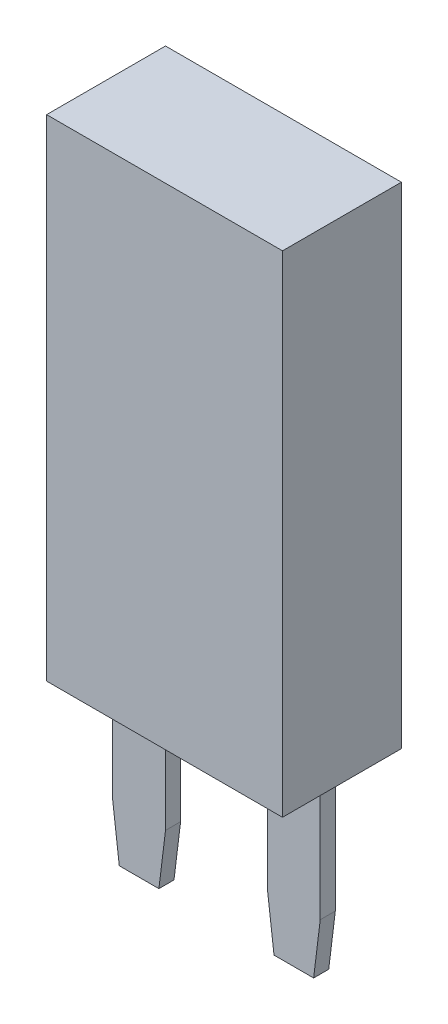
ISO-10303-21;
HEADER;
FILE_DESCRIPTION(('STEP AP214'),'2;1');
FILE_NAME('part.step','',(''),(''),'','','');
FILE_SCHEMA(('AUTOMOTIVE_DESIGN { 1 0 10303 214 1 1 1 1 }'));
ENDSEC;
DATA;
#1=APPLICATION_CONTEXT('core data for automotive mechanical design processes');
#2=APPLICATION_PROTOCOL_DEFINITION('international standard','automotive_design',2000,#1);
#3=PRODUCT_CONTEXT('',#1,'mechanical');
#4=PRODUCT('Part','Part','',(#3));
#5=PRODUCT_RELATED_PRODUCT_CATEGORY('part','',(#4));
#6=PRODUCT_DEFINITION_FORMATION('','',#4);
#7=PRODUCT_DEFINITION_CONTEXT('part definition',#1,'design');
#8=PRODUCT_DEFINITION('design','',#6,#7);
#9=PRODUCT_DEFINITION_SHAPE('','',#8);
#10=(LENGTH_UNIT() NAMED_UNIT(*) SI_UNIT(.MILLI.,.METRE.));
#11=(NAMED_UNIT(*) PLANE_ANGLE_UNIT() SI_UNIT($,.RADIAN.));
#12=(NAMED_UNIT(*) SI_UNIT($,.STERADIAN.) SOLID_ANGLE_UNIT());
#13=UNCERTAINTY_MEASURE_WITH_UNIT(LENGTH_MEASURE(1.E-05),#10,'distance_accuracy_value','');
#14=(GEOMETRIC_REPRESENTATION_CONTEXT(3) GLOBAL_UNCERTAINTY_ASSIGNED_CONTEXT((#13)) GLOBAL_UNIT_ASSIGNED_CONTEXT((#10,
#11,#12)) REPRESENTATION_CONTEXT('',''));
#15=CARTESIAN_POINT('',(0.,0.,0.));
#16=DIRECTION('',(0.,0.,1.));
#17=DIRECTION('',(1.,0.,0.));
#18=AXIS2_PLACEMENT_3D('',#15,#16,#17);
#19=CARTESIAN_POINT('',(-6.25,-13.,3.15));
#20=DIRECTION('',(0.,1.,0.));
#21=DIRECTION('',(0.,0.,1.));
#22=AXIS2_PLACEMENT_3D('',#19,#20,#21);
#23=PLANE('',#22);
#24=DIRECTION('',(0.,0.,-1.));
#25=VECTOR('',#24,1.);
#26=CARTESIAN_POINT('',(-5.5,-13.,0.4));
#27=LINE('',#26,#25);
#28=CARTESIAN_POINT('',(-5.5,-13.,0.4));
#29=VERTEX_POINT('',#28);
#30=CARTESIAN_POINT('',(-5.5,-13.,-0.4));
#31=VERTEX_POINT('',#30);
#32=EDGE_CURVE('E189',#29,#31,#27,.T.);
#33=ORIENTED_EDGE('',*,*,#32,.F.);
#34=DIRECTION('',(-1.,0.,0.));
#35=VECTOR('',#34,1.);
#36=CARTESIAN_POINT('',(-5.5,-13.,0.4));
#37=LINE('',#36,#35);
#38=CARTESIAN_POINT('',(-2.7,-13.,0.4));
#39=VERTEX_POINT('',#38);
#40=EDGE_CURVE('E194',#39,#29,#37,.T.);
#41=ORIENTED_EDGE('',*,*,#40,.F.);
#42=DIRECTION('',(0.,0.,1.));
#43=VECTOR('',#42,1.);
#44=CARTESIAN_POINT('',(-2.7,-13.,0.4));
#45=LINE('',#44,#43);
#46=CARTESIAN_POINT('',(-2.7,-13.,-0.4));
#47=VERTEX_POINT('',#46);
#48=EDGE_CURVE('E203',#47,#39,#45,.T.);
#49=ORIENTED_EDGE('',*,*,#48,.F.);
#50=DIRECTION('',(1.,0.,0.));
#51=VECTOR('',#50,1.);
#52=CARTESIAN_POINT('',(-5.5,-13.,-0.4));
#53=LINE('',#52,#51);
#54=EDGE_CURVE('E200',#31,#47,#53,.T.);
#55=ORIENTED_EDGE('',*,*,#54,.F.);
#56=EDGE_LOOP('',(#33,#41,#49,#55));
#57=FACE_BOUND('',#56,.T.);
#58=DIRECTION('',(1.,0.,0.));
#59=VECTOR('',#58,1.);
#60=CARTESIAN_POINT('',(-6.25,-13.,-3.15));
#61=LINE('',#60,#59);
#62=CARTESIAN_POINT('',(-6.25,-13.,-3.15));
#63=VERTEX_POINT('',#62);
#64=CARTESIAN_POINT('',(6.25,-13.,-3.15));
#65=VERTEX_POINT('',#64);
#66=EDGE_CURVE('E220',#63,#65,#61,.T.);
#67=ORIENTED_EDGE('',*,*,#66,.T.);
#68=DIRECTION('',(0.,0.,-1.));
#69=VECTOR('',#68,1.);
#70=CARTESIAN_POINT('',(6.25,-13.,3.15));
#71=LINE('',#70,#69);
#72=CARTESIAN_POINT('',(6.25,-13.,3.15));
#73=VERTEX_POINT('',#72);
#74=EDGE_CURVE('E226',#73,#65,#71,.T.);
#75=ORIENTED_EDGE('',*,*,#74,.F.);
#76=DIRECTION('',(1.,0.,0.));
#77=VECTOR('',#76,1.);
#78=CARTESIAN_POINT('',(-6.25,-13.,3.15));
#79=LINE('',#78,#77);
#80=CARTESIAN_POINT('',(-6.25,-13.,3.15));
#81=VERTEX_POINT('',#80);
#82=EDGE_CURVE('E224',#81,#73,#79,.T.);
#83=ORIENTED_EDGE('',*,*,#82,.F.);
#84=DIRECTION('',(0.,0.,-1.));
#85=VECTOR('',#84,1.);
#86=CARTESIAN_POINT('',(-6.25,-13.,3.15));
#87=LINE('',#86,#85);
#88=EDGE_CURVE('E236',#81,#63,#87,.T.);
#89=ORIENTED_EDGE('',*,*,#88,.T.);
#90=EDGE_LOOP('',(#67,#75,#83,#89));
#91=FACE_BOUND('',#90,.T.);
#92=DIRECTION('',(-1.,0.,0.));
#93=VECTOR('',#92,1.);
#94=CARTESIAN_POINT('',(5.5,-13.,0.399999999999999));
#95=LINE('',#94,#93);
#96=CARTESIAN_POINT('',(5.5,-13.,0.399999999999999));
#97=VERTEX_POINT('',#96);
#98=CARTESIAN_POINT('',(2.7,-13.,0.399999999999999));
#99=VERTEX_POINT('',#98);
#100=EDGE_CURVE('E157',#97,#99,#95,.T.);
#101=ORIENTED_EDGE('',*,*,#100,.F.);
#102=DIRECTION('',(0.,0.,1.));
#103=VECTOR('',#102,1.);
#104=CARTESIAN_POINT('',(5.5,-13.,0.399999999999999));
#105=LINE('',#104,#103);
#106=CARTESIAN_POINT('',(5.5,-13.,-0.399999999999998));
#107=VERTEX_POINT('',#106);
#108=EDGE_CURVE('E169',#107,#97,#105,.T.);
#109=ORIENTED_EDGE('',*,*,#108,.F.);
#110=DIRECTION('',(1.,0.,0.));
#111=VECTOR('',#110,1.);
#112=CARTESIAN_POINT('',(5.5,-13.,-0.399999999999999));
#113=LINE('',#112,#111);
#114=CARTESIAN_POINT('',(2.7,-13.,-0.399999999999999));
#115=VERTEX_POINT('',#114);
#116=EDGE_CURVE('E177',#115,#107,#113,.T.);
#117=ORIENTED_EDGE('',*,*,#116,.F.);
#118=DIRECTION('',(0.,0.,-1.));
#119=VECTOR('',#118,1.);
#120=CARTESIAN_POINT('',(2.7,-13.,0.399999999999999));
#121=LINE('',#120,#119);
#122=EDGE_CURVE('E172',#99,#115,#121,.T.);
#123=ORIENTED_EDGE('',*,*,#122,.F.);
#124=EDGE_LOOP('',(#101,#109,#117,#123));
#125=FACE_BOUND('',#124,.T.);
#126=ADVANCED_FACE('F38',(#57,#91,#125),#23,.F.);
#127=CARTESIAN_POINT('',(6.25,13.,3.15));
#128=DIRECTION('',(-1.,0.,0.));
#129=DIRECTION('',(0.,-1.,0.));
#130=AXIS2_PLACEMENT_3D('',#127,#128,#129);
#131=PLANE('',#130);
#132=DIRECTION('',(0.,1.,0.));
#133=VECTOR('',#132,1.);
#134=CARTESIAN_POINT('',(6.25,13.,-3.15));
#135=LINE('',#134,#133);
#136=CARTESIAN_POINT('',(6.25,13.,-3.15));
#137=VERTEX_POINT('',#136);
#138=EDGE_CURVE('E215',#65,#137,#135,.T.);
#139=ORIENTED_EDGE('',*,*,#138,.T.);
#140=DIRECTION('',(0.,0.,-1.));
#141=VECTOR('',#140,1.);
#142=CARTESIAN_POINT('',(6.25,13.,3.15));
#143=LINE('',#142,#141);
#144=CARTESIAN_POINT('',(6.25,13.,3.15));
#145=VERTEX_POINT('',#144);
#146=EDGE_CURVE('E242',#145,#137,#143,.T.);
#147=ORIENTED_EDGE('',*,*,#146,.F.);
#148=DIRECTION('',(0.,1.,0.));
#149=VECTOR('',#148,1.);
#150=CARTESIAN_POINT('',(6.25,13.,3.15));
#151=LINE('',#150,#149);
#152=EDGE_CURVE('E216',#73,#145,#151,.T.);
#153=ORIENTED_EDGE('',*,*,#152,.F.);
#154=ORIENTED_EDGE('',*,*,#74,.T.);
#155=EDGE_LOOP('',(#139,#147,#153,#154));
#156=FACE_BOUND('',#155,.T.);
#157=ADVANCED_FACE('F303',(#156),#131,.F.);
#158=CARTESIAN_POINT('',(-6.25,13.,3.15));
#159=DIRECTION('',(0.,-1.,0.));
#160=DIRECTION('',(0.,0.,-1.));
#161=AXIS2_PLACEMENT_3D('',#158,#159,#160);
#162=PLANE('',#161);
#163=DIRECTION('',(-1.,0.,0.));
#164=VECTOR('',#163,1.);
#165=CARTESIAN_POINT('',(-6.25,13.,-3.15));
#166=LINE('',#165,#164);
#167=CARTESIAN_POINT('',(-6.25,13.,-3.15));
#168=VERTEX_POINT('',#167);
#169=EDGE_CURVE('E229',#137,#168,#166,.T.);
#170=ORIENTED_EDGE('',*,*,#169,.T.);
#171=DIRECTION('',(0.,0.,-1.));
#172=VECTOR('',#171,1.);
#173=CARTESIAN_POINT('',(-6.25,13.,3.15));
#174=LINE('',#173,#172);
#175=CARTESIAN_POINT('',(-6.25,13.,3.15));
#176=VERTEX_POINT('',#175);
#177=EDGE_CURVE('E239',#176,#168,#174,.T.);
#178=ORIENTED_EDGE('',*,*,#177,.F.);
#179=DIRECTION('',(-1.,0.,0.));
#180=VECTOR('',#179,1.);
#181=CARTESIAN_POINT('',(-6.25,13.,3.15));
#182=LINE('',#181,#180);
#183=EDGE_CURVE('E219',#145,#176,#182,.T.);
#184=ORIENTED_EDGE('',*,*,#183,.F.);
#185=ORIENTED_EDGE('',*,*,#146,.T.);
#186=EDGE_LOOP('',(#170,#178,#184,#185));
#187=FACE_BOUND('',#186,.T.);
#188=ADVANCED_FACE('F308',(#187),#162,.F.);
#189=CARTESIAN_POINT('',(-6.25,13.,3.15));
#190=DIRECTION('',(1.,0.,0.));
#191=DIRECTION('',(0.,1.,0.));
#192=AXIS2_PLACEMENT_3D('',#189,#190,#191);
#193=PLANE('',#192);
#194=DIRECTION('',(0.,-1.,0.));
#195=VECTOR('',#194,1.);
#196=CARTESIAN_POINT('',(-6.25,13.,-3.15));
#197=LINE('',#196,#195);
#198=EDGE_CURVE('E231',#168,#63,#197,.T.);
#199=ORIENTED_EDGE('',*,*,#198,.T.);
#200=ORIENTED_EDGE('',*,*,#88,.F.);
#201=DIRECTION('',(0.,-1.,0.));
#202=VECTOR('',#201,1.);
#203=CARTESIAN_POINT('',(-6.25,13.,3.15));
#204=LINE('',#203,#202);
#205=EDGE_CURVE('E222',#176,#81,#204,.T.);
#206=ORIENTED_EDGE('',*,*,#205,.F.);
#207=ORIENTED_EDGE('',*,*,#177,.T.);
#208=EDGE_LOOP('',(#199,#200,#206,#207));
#209=FACE_BOUND('',#208,.T.);
#210=ADVANCED_FACE('F315',(#209),#193,.F.);
#211=CARTESIAN_POINT('',(0.,0.,3.15));
#212=DIRECTION('',(0.,0.,1.));
#213=DIRECTION('',(1.,0.,0.));
#214=AXIS2_PLACEMENT_3D('',#211,#212,#213);
#215=PLANE('',#214);
#216=ORIENTED_EDGE('',*,*,#152,.T.);
#217=ORIENTED_EDGE('',*,*,#183,.T.);
#218=ORIENTED_EDGE('',*,*,#205,.T.);
#219=ORIENTED_EDGE('',*,*,#82,.T.);
#220=EDGE_LOOP('',(#216,#217,#218,#219));
#221=FACE_BOUND('',#220,.T.);
#222=ADVANCED_FACE('F318',(#221),#215,.T.);
#223=CARTESIAN_POINT('',(0.,0.,-3.15));
#224=DIRECTION('',(0.,0.,1.));
#225=DIRECTION('',(1.,0.,0.));
#226=AXIS2_PLACEMENT_3D('',#223,#224,#225);
#227=PLANE('',#226);
#228=ORIENTED_EDGE('',*,*,#138,.F.);
#229=ORIENTED_EDGE('',*,*,#66,.F.);
#230=ORIENTED_EDGE('',*,*,#198,.F.);
#231=ORIENTED_EDGE('',*,*,#169,.F.);
#232=EDGE_LOOP('',(#228,#229,#230,#231));
#233=FACE_BOUND('',#232,.T.);
#234=ADVANCED_FACE('F313',(#233),#227,.F.);
#235=CARTESIAN_POINT('',(-5.5,-22.3,0.4));
#236=DIRECTION('',(1.,0.,0.));
#237=DIRECTION('',(0.,0.,-1.));
#238=AXIS2_PLACEMENT_3D('',#235,#236,#237);
#239=PLANE('',#238);
#240=DIRECTION('',(0.,1.,0.));
#241=VECTOR('',#240,1.);
#242=CARTESIAN_POINT('',(-5.5,-22.3,-0.4));
#243=LINE('',#242,#241);
#244=CARTESIAN_POINT('',(-5.5,-19.4494787502088,-0.4));
#245=VERTEX_POINT('',#244);
#246=EDGE_CURVE('E213',#245,#31,#243,.T.);
#247=ORIENTED_EDGE('',*,*,#246,.F.);
#248=DIRECTION('',(0.,0.,1.));
#249=VECTOR('',#248,1.);
#250=CARTESIAN_POINT('',(-5.5,-19.4494787502088,0.4));
#251=LINE('',#250,#249);
#252=CARTESIAN_POINT('',(-5.5,-19.4494787502088,0.4));
#253=VERTEX_POINT('',#252);
#254=EDGE_CURVE('E11',#245,#253,#251,.T.);
#255=ORIENTED_EDGE('',*,*,#254,.T.);
#256=DIRECTION('',(0.,1.,0.));
#257=VECTOR('',#256,1.);
#258=CARTESIAN_POINT('',(-5.5,-22.3,0.4));
#259=LINE('',#258,#257);
#260=EDGE_CURVE('E197',#253,#29,#259,.T.);
#261=ORIENTED_EDGE('',*,*,#260,.T.);
#262=ORIENTED_EDGE('',*,*,#32,.T.);
#263=EDGE_LOOP('',(#247,#255,#261,#262));
#264=FACE_BOUND('',#263,.T.);
#265=ADVANCED_FACE('F293',(#264),#239,.F.);
#266=CARTESIAN_POINT('',(-5.5,-22.3,-0.4));
#267=DIRECTION('',(0.,0.,1.));
#268=DIRECTION('',(1.,0.,0.));
#269=AXIS2_PLACEMENT_3D('',#266,#267,#268);
#270=PLANE('',#269);
#271=DIRECTION('',(0.,1.,0.));
#272=VECTOR('',#271,1.);
#273=CARTESIAN_POINT('',(-2.7,-22.3,-0.4));
#274=LINE('',#273,#272);
#275=CARTESIAN_POINT('',(-2.7,-19.4494787502088,-0.4));
#276=VERTEX_POINT('',#275);
#277=EDGE_CURVE('E211',#276,#47,#274,.T.);
#278=ORIENTED_EDGE('',*,*,#277,.F.);
#279=DIRECTION('',(-0.121869343405145,-0.992546151641322,0.));
#280=VECTOR('',#279,1.);
#281=CARTESIAN_POINT('',(-3.05,-22.3,-0.4));
#282=LINE('',#281,#280);
#283=CARTESIAN_POINT('',(-3.05,-22.3,-0.4));
#284=VERTEX_POINT('',#283);
#285=EDGE_CURVE('E47',#276,#284,#282,.T.);
#286=ORIENTED_EDGE('',*,*,#285,.T.);
#287=DIRECTION('',(1.,0.,0.));
#288=VECTOR('',#287,1.);
#289=CARTESIAN_POINT('',(-5.5,-22.3,-0.4));
#290=LINE('',#289,#288);
#291=CARTESIAN_POINT('',(-5.15,-22.3,-0.4));
#292=VERTEX_POINT('',#291);
#293=EDGE_CURVE('E190',#292,#284,#290,.T.);
#294=ORIENTED_EDGE('',*,*,#293,.F.);
#295=DIRECTION('',(-0.121869343405145,0.992546151641322,0.));
#296=VECTOR('',#295,1.);
#297=CARTESIAN_POINT('',(-5.15,-22.3,-0.4));
#298=LINE('',#297,#296);
#299=EDGE_CURVE('E54',#292,#245,#298,.T.);
#300=ORIENTED_EDGE('',*,*,#299,.T.);
#301=ORIENTED_EDGE('',*,*,#246,.T.);
#302=ORIENTED_EDGE('',*,*,#54,.T.);
#303=EDGE_LOOP('',(#278,#286,#294,#300,#301,#302));
#304=FACE_BOUND('',#303,.T.);
#305=ADVANCED_FACE('F274',(#304),#270,.F.);
#306=CARTESIAN_POINT('',(-2.7,-22.3,0.4));
#307=DIRECTION('',(-1.,0.,0.));
#308=DIRECTION('',(0.,0.,1.));
#309=AXIS2_PLACEMENT_3D('',#306,#307,#308);
#310=PLANE('',#309);
#311=DIRECTION('',(0.,1.,0.));
#312=VECTOR('',#311,1.);
#313=CARTESIAN_POINT('',(-2.7,-22.3,0.4));
#314=LINE('',#313,#312);
#315=CARTESIAN_POINT('',(-2.7,-19.4494787502088,0.4));
#316=VERTEX_POINT('',#315);
#317=EDGE_CURVE('E209',#316,#39,#314,.T.);
#318=ORIENTED_EDGE('',*,*,#317,.F.);
#319=DIRECTION('',(0.,0.,-1.));
#320=VECTOR('',#319,1.);
#321=CARTESIAN_POINT('',(-2.7,-19.4494787502088,-0.4));
#322=LINE('',#321,#320);
#323=EDGE_CURVE('E62',#316,#276,#322,.T.);
#324=ORIENTED_EDGE('',*,*,#323,.T.);
#325=ORIENTED_EDGE('',*,*,#277,.T.);
#326=ORIENTED_EDGE('',*,*,#48,.T.);
#327=EDGE_LOOP('',(#318,#324,#325,#326));
#328=FACE_BOUND('',#327,.T.);
#329=ADVANCED_FACE('F285',(#328),#310,.F.);
#330=CARTESIAN_POINT('',(-5.5,-22.3,0.4));
#331=DIRECTION('',(0.,0.,-1.));
#332=DIRECTION('',(-1.,0.,0.));
#333=AXIS2_PLACEMENT_3D('',#330,#331,#332);
#334=PLANE('',#333);
#335=DIRECTION('',(-1.,0.,0.));
#336=VECTOR('',#335,1.);
#337=CARTESIAN_POINT('',(-5.5,-22.3,0.4));
#338=LINE('',#337,#336);
#339=CARTESIAN_POINT('',(-3.05,-22.3,0.4));
#340=VERTEX_POINT('',#339);
#341=CARTESIAN_POINT('',(-5.15,-22.3,0.4));
#342=VERTEX_POINT('',#341);
#343=EDGE_CURVE('E193',#340,#342,#338,.T.);
#344=ORIENTED_EDGE('',*,*,#343,.F.);
#345=DIRECTION('',(0.121869343405145,0.992546151641322,0.));
#346=VECTOR('',#345,1.);
#347=CARTESIAN_POINT('',(-3.05,-22.3,0.4));
#348=LINE('',#347,#346);
#349=EDGE_CURVE('E270',#340,#316,#348,.T.);
#350=ORIENTED_EDGE('',*,*,#349,.T.);
#351=ORIENTED_EDGE('',*,*,#317,.T.);
#352=ORIENTED_EDGE('',*,*,#40,.T.);
#353=ORIENTED_EDGE('',*,*,#260,.F.);
#354=DIRECTION('',(0.121869343405145,-0.992546151641322,0.));
#355=VECTOR('',#354,1.);
#356=CARTESIAN_POINT('',(-5.15,-22.3,0.4));
#357=LINE('',#356,#355);
#358=EDGE_CURVE('E268',#253,#342,#357,.T.);
#359=ORIENTED_EDGE('',*,*,#358,.T.);
#360=EDGE_LOOP('',(#344,#350,#351,#352,#353,#359));
#361=FACE_BOUND('',#360,.T.);
#362=ADVANCED_FACE('F283',(#361),#334,.F.);
#363=CARTESIAN_POINT('',(0.,-22.3,0.));
#364=DIRECTION('',(0.,-1.,0.));
#365=DIRECTION('',(0.,0.,-1.));
#366=AXIS2_PLACEMENT_3D('',#363,#364,#365);
#367=PLANE('',#366);
#368=ORIENTED_EDGE('',*,*,#293,.T.);
#369=DIRECTION('',(0.,0.,1.));
#370=VECTOR('',#369,1.);
#371=CARTESIAN_POINT('',(-3.05,-22.3,0.4));
#372=LINE('',#371,#370);
#373=EDGE_CURVE('E265',#284,#340,#372,.T.);
#374=ORIENTED_EDGE('',*,*,#373,.T.);
#375=ORIENTED_EDGE('',*,*,#343,.T.);
#376=DIRECTION('',(0.,0.,-1.));
#377=VECTOR('',#376,1.);
#378=CARTESIAN_POINT('',(-5.15,-22.3,-0.4));
#379=LINE('',#378,#377);
#380=EDGE_CURVE('E262',#342,#292,#379,.T.);
#381=ORIENTED_EDGE('',*,*,#380,.T.);
#382=EDGE_LOOP('',(#368,#374,#375,#381));
#383=FACE_BOUND('',#382,.T.);
#384=ADVANCED_FACE('F278',(#383),#367,.T.);
#385=CARTESIAN_POINT('',(5.5,-22.3,0.399999999999999));
#386=DIRECTION('',(0.,0.,-1.));
#387=DIRECTION('',(-1.,0.,0.));
#388=AXIS2_PLACEMENT_3D('',#385,#386,#387);
#389=PLANE('',#388);
#390=DIRECTION('',(-1.,0.,0.));
#391=VECTOR('',#390,1.);
#392=CARTESIAN_POINT('',(5.5,-22.3,0.399999999999999));
#393=LINE('',#392,#391);
#394=CARTESIAN_POINT('',(5.15,-22.3,0.399999999999999));
#395=VERTEX_POINT('',#394);
#396=CARTESIAN_POINT('',(3.05,-22.3,0.399999999999999));
#397=VERTEX_POINT('',#396);
#398=EDGE_CURVE('E176',#395,#397,#393,.T.);
#399=ORIENTED_EDGE('',*,*,#398,.F.);
#400=DIRECTION('',(0.121869343405145,0.992546151641322,0.));
#401=VECTOR('',#400,1.);
#402=CARTESIAN_POINT('',(5.15,-22.3,0.399999999999999));
#403=LINE('',#402,#401);
#404=CARTESIAN_POINT('',(5.5,-19.4494787502088,0.399999999999999));
#405=VERTEX_POINT('',#404);
#406=EDGE_CURVE('E158',#395,#405,#403,.T.);
#407=ORIENTED_EDGE('',*,*,#406,.T.);
#408=DIRECTION('',(0.,1.,0.));
#409=VECTOR('',#408,1.);
#410=CARTESIAN_POINT('',(5.5,-22.3,0.399999999999999));
#411=LINE('',#410,#409);
#412=EDGE_CURVE('E152',#405,#97,#411,.T.);
#413=ORIENTED_EDGE('',*,*,#412,.T.);
#414=ORIENTED_EDGE('',*,*,#100,.T.);
#415=DIRECTION('',(0.,1.,0.));
#416=VECTOR('',#415,1.);
#417=CARTESIAN_POINT('',(2.7,-22.3,0.399999999999999));
#418=LINE('',#417,#416);
#419=CARTESIAN_POINT('',(2.7,-19.4494787502088,0.399999999999999));
#420=VERTEX_POINT('',#419);
#421=EDGE_CURVE('E187',#420,#99,#418,.T.);
#422=ORIENTED_EDGE('',*,*,#421,.F.);
#423=DIRECTION('',(0.121869343405145,-0.992546151641322,0.));
#424=VECTOR('',#423,1.);
#425=CARTESIAN_POINT('',(3.05,-22.3,0.399999999999999));
#426=LINE('',#425,#424);
#427=EDGE_CURVE('E251',#420,#397,#426,.T.);
#428=ORIENTED_EDGE('',*,*,#427,.T.);
#429=EDGE_LOOP('',(#399,#407,#413,#414,#422,#428));
#430=FACE_BOUND('',#429,.T.);
#431=ADVANCED_FACE('F155',(#430),#389,.F.);
#432=CARTESIAN_POINT('',(2.7,-22.3,0.399999999999999));
#433=DIRECTION('',(1.,0.,0.));
#434=DIRECTION('',(0.,0.,-1.));
#435=AXIS2_PLACEMENT_3D('',#432,#433,#434);
#436=PLANE('',#435);
#437=DIRECTION('',(0.,1.,0.));
#438=VECTOR('',#437,1.);
#439=CARTESIAN_POINT('',(2.7,-22.3,-0.399999999999999));
#440=LINE('',#439,#438);
#441=CARTESIAN_POINT('',(2.7,-19.4494787502088,-0.399999999999999));
#442=VERTEX_POINT('',#441);
#443=EDGE_CURVE('E185',#442,#115,#440,.T.);
#444=ORIENTED_EDGE('',*,*,#443,.F.);
#445=DIRECTION('',(0.,0.,1.));
#446=VECTOR('',#445,1.);
#447=CARTESIAN_POINT('',(2.7,-19.4494787502088,0.399999999999999));
#448=LINE('',#447,#446);
#449=EDGE_CURVE('E260',#442,#420,#448,.T.);
#450=ORIENTED_EDGE('',*,*,#449,.T.);
#451=ORIENTED_EDGE('',*,*,#421,.T.);
#452=ORIENTED_EDGE('',*,*,#122,.T.);
#453=EDGE_LOOP('',(#444,#450,#451,#452));
#454=FACE_BOUND('',#453,.T.);
#455=ADVANCED_FACE('F355',(#454),#436,.F.);
#456=CARTESIAN_POINT('',(5.5,-22.3,-0.399999999999999));
#457=DIRECTION('',(0.,0.,1.));
#458=DIRECTION('',(1.,0.,0.));
#459=AXIS2_PLACEMENT_3D('',#456,#457,#458);
#460=PLANE('',#459);
#461=DIRECTION('',(0.,1.,0.));
#462=VECTOR('',#461,1.);
#463=CARTESIAN_POINT('',(5.5,-22.3,-0.399999999999999));
#464=LINE('',#463,#462);
#465=CARTESIAN_POINT('',(5.5,-19.4494787502088,-0.399999999999999));
#466=VERTEX_POINT('',#465);
#467=EDGE_CURVE('E162',#466,#107,#464,.T.);
#468=ORIENTED_EDGE('',*,*,#467,.F.);
#469=DIRECTION('',(-0.121869343405145,-0.992546151641322,0.));
#470=VECTOR('',#469,1.);
#471=CARTESIAN_POINT('',(5.15,-22.3,-0.399999999999999));
#472=LINE('',#471,#470);
#473=CARTESIAN_POINT('',(5.15,-22.3,-0.399999999999999));
#474=VERTEX_POINT('',#473);
#475=EDGE_CURVE('E258',#466,#474,#472,.T.);
#476=ORIENTED_EDGE('',*,*,#475,.T.);
#477=DIRECTION('',(1.,0.,0.));
#478=VECTOR('',#477,1.);
#479=CARTESIAN_POINT('',(5.5,-22.3,-0.399999999999999));
#480=LINE('',#479,#478);
#481=CARTESIAN_POINT('',(3.05,-22.3,-0.399999999999999));
#482=VERTEX_POINT('',#481);
#483=EDGE_CURVE('E163',#482,#474,#480,.T.);
#484=ORIENTED_EDGE('',*,*,#483,.F.);
#485=DIRECTION('',(-0.121869343405145,0.992546151641322,0.));
#486=VECTOR('',#485,1.);
#487=CARTESIAN_POINT('',(3.05,-22.3,-0.399999999999999));
#488=LINE('',#487,#486);
#489=EDGE_CURVE('E256',#482,#442,#488,.T.);
#490=ORIENTED_EDGE('',*,*,#489,.T.);
#491=ORIENTED_EDGE('',*,*,#443,.T.);
#492=ORIENTED_EDGE('',*,*,#116,.T.);
#493=EDGE_LOOP('',(#468,#476,#484,#490,#491,#492));
#494=FACE_BOUND('',#493,.T.);
#495=ADVANCED_FACE('F352',(#494),#460,.F.);
#496=CARTESIAN_POINT('',(5.5,-22.3,0.399999999999999));
#497=DIRECTION('',(-1.,0.,0.));
#498=DIRECTION('',(0.,0.,1.));
#499=AXIS2_PLACEMENT_3D('',#496,#497,#498);
#500=PLANE('',#499);
#501=ORIENTED_EDGE('',*,*,#412,.F.);
#502=DIRECTION('',(0.,0.,-1.));
#503=VECTOR('',#502,1.);
#504=CARTESIAN_POINT('',(5.5,-19.4494787502088,-0.399999999999999));
#505=LINE('',#504,#503);
#506=EDGE_CURVE('E254',#405,#466,#505,.T.);
#507=ORIENTED_EDGE('',*,*,#506,.T.);
#508=ORIENTED_EDGE('',*,*,#467,.T.);
#509=ORIENTED_EDGE('',*,*,#108,.T.);
#510=EDGE_LOOP('',(#501,#507,#508,#509));
#511=FACE_BOUND('',#510,.T.);
#512=ADVANCED_FACE('F174',(#511),#500,.F.);
#513=CARTESIAN_POINT('',(0.,-22.3,0.));
#514=DIRECTION('',(0.,-1.,0.));
#515=DIRECTION('',(0.,0.,-1.));
#516=AXIS2_PLACEMENT_3D('',#513,#514,#515);
#517=PLANE('',#516);
#518=ORIENTED_EDGE('',*,*,#483,.T.);
#519=DIRECTION('',(0.,0.,1.));
#520=VECTOR('',#519,1.);
#521=CARTESIAN_POINT('',(5.15,-22.3,0.399999999999999));
#522=LINE('',#521,#520);
#523=EDGE_CURVE('E248',#474,#395,#522,.T.);
#524=ORIENTED_EDGE('',*,*,#523,.T.);
#525=ORIENTED_EDGE('',*,*,#398,.T.);
#526=DIRECTION('',(0.,0.,-1.));
#527=VECTOR('',#526,1.);
#528=CARTESIAN_POINT('',(3.05,-22.3,-0.399999999999999));
#529=LINE('',#528,#527);
#530=EDGE_CURVE('E245',#397,#482,#529,.T.);
#531=ORIENTED_EDGE('',*,*,#530,.T.);
#532=EDGE_LOOP('',(#518,#524,#525,#531));
#533=FACE_BOUND('',#532,.T.);
#534=ADVANCED_FACE('F330',(#533),#517,.T.);
#535=CARTESIAN_POINT('',(5.15,-22.3,0.));
#536=DIRECTION('',(0.992546151641322,-0.121869343405145,0.));
#537=DIRECTION('',(0.,0.,-1.));
#538=AXIS2_PLACEMENT_3D('',#535,#536,#537);
#539=PLANE('',#538);
#540=ORIENTED_EDGE('',*,*,#475,.F.);
#541=ORIENTED_EDGE('',*,*,#506,.F.);
#542=ORIENTED_EDGE('',*,*,#406,.F.);
#543=ORIENTED_EDGE('',*,*,#523,.F.);
#544=EDGE_LOOP('',(#540,#541,#542,#543));
#545=FACE_BOUND('',#544,.T.);
#546=ADVANCED_FACE('F324',(#545),#539,.T.);
#547=CARTESIAN_POINT('',(3.05,-22.3,0.));
#548=DIRECTION('',(-0.992546151641322,-0.121869343405145,0.));
#549=DIRECTION('',(0.,0.,1.));
#550=AXIS2_PLACEMENT_3D('',#547,#548,#549);
#551=PLANE('',#550);
#552=ORIENTED_EDGE('',*,*,#427,.F.);
#553=ORIENTED_EDGE('',*,*,#449,.F.);
#554=ORIENTED_EDGE('',*,*,#489,.F.);
#555=ORIENTED_EDGE('',*,*,#530,.F.);
#556=EDGE_LOOP('',(#552,#553,#554,#555));
#557=FACE_BOUND('',#556,.T.);
#558=ADVANCED_FACE('F301',(#557),#551,.T.);
#559=CARTESIAN_POINT('',(-3.05,-22.3,0.));
#560=DIRECTION('',(0.992546151641322,-0.121869343405145,0.));
#561=DIRECTION('',(0.,0.,-1.));
#562=AXIS2_PLACEMENT_3D('',#559,#560,#561);
#563=PLANE('',#562);
#564=ORIENTED_EDGE('',*,*,#285,.F.);
#565=ORIENTED_EDGE('',*,*,#323,.F.);
#566=ORIENTED_EDGE('',*,*,#349,.F.);
#567=ORIENTED_EDGE('',*,*,#373,.F.);
#568=EDGE_LOOP('',(#564,#565,#566,#567));
#569=FACE_BOUND('',#568,.T.);
#570=ADVANCED_FACE('F281',(#569),#563,.T.);
#571=CARTESIAN_POINT('',(-5.15,-22.3,0.));
#572=DIRECTION('',(-0.992546151641322,-0.121869343405145,0.));
#573=DIRECTION('',(0.,0.,1.));
#574=AXIS2_PLACEMENT_3D('',#571,#572,#573);
#575=PLANE('',#574);
#576=ORIENTED_EDGE('',*,*,#358,.F.);
#577=ORIENTED_EDGE('',*,*,#254,.F.);
#578=ORIENTED_EDGE('',*,*,#299,.F.);
#579=ORIENTED_EDGE('',*,*,#380,.F.);
#580=EDGE_LOOP('',(#576,#577,#578,#579));
#581=FACE_BOUND('',#580,.T.);
#582=ADVANCED_FACE('F41',(#581),#575,.T.);
#583=CLOSED_SHELL('',(#126,#157,#188,#210,#222,#234,#265,#305,#329,#362,#384,#431,#455,#495,
#512,#534,#546,#558,#570,#582));
#584=MANIFOLD_SOLID_BREP('B2',#583);
#585=ADVANCED_BREP_SHAPE_REPRESENTATION('',(#18,#584),#14);
#586=SHAPE_DEFINITION_REPRESENTATION(#9,#585);
ENDSEC;
END-ISO-10303-21;
